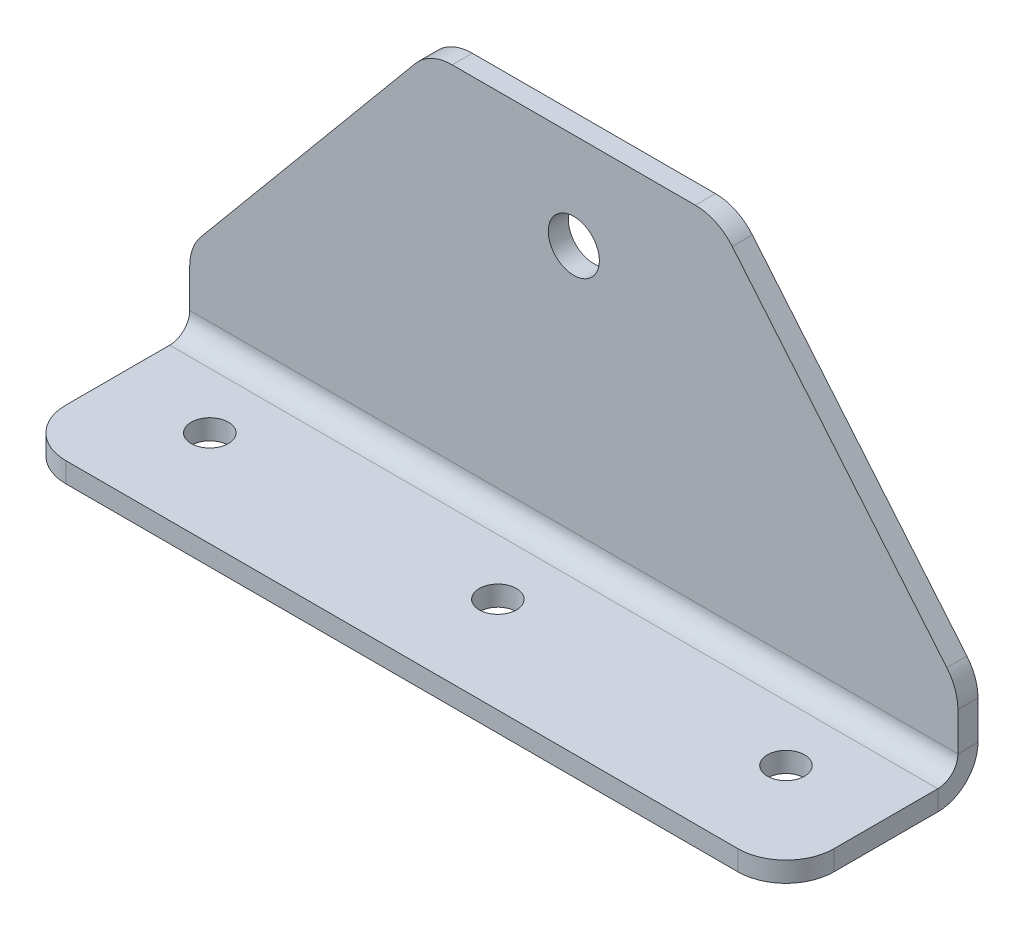
ISO-10303-21;
HEADER;
FILE_DESCRIPTION(('STEP AP214'),'2;1');
FILE_NAME('part.step','',(''),(''),'','','');
FILE_SCHEMA(('AUTOMOTIVE_DESIGN { 1 0 10303 214 1 1 1 1 }'));
ENDSEC;
DATA;
#1=APPLICATION_CONTEXT('core data for automotive mechanical design processes');
#2=APPLICATION_PROTOCOL_DEFINITION('international standard','automotive_design',2000,#1);
#3=PRODUCT_CONTEXT('',#1,'mechanical');
#4=PRODUCT('Part','Part','',(#3));
#5=PRODUCT_RELATED_PRODUCT_CATEGORY('part','',(#4));
#6=PRODUCT_DEFINITION_FORMATION('','',#4);
#7=PRODUCT_DEFINITION_CONTEXT('part definition',#1,'design');
#8=PRODUCT_DEFINITION('design','',#6,#7);
#9=PRODUCT_DEFINITION_SHAPE('','',#8);
#10=(LENGTH_UNIT() NAMED_UNIT(*) SI_UNIT(.MILLI.,.METRE.));
#11=(NAMED_UNIT(*) PLANE_ANGLE_UNIT() SI_UNIT($,.RADIAN.));
#12=(NAMED_UNIT(*) SI_UNIT($,.STERADIAN.) SOLID_ANGLE_UNIT());
#13=UNCERTAINTY_MEASURE_WITH_UNIT(LENGTH_MEASURE(1.E-05),#10,'distance_accuracy_value','');
#14=(GEOMETRIC_REPRESENTATION_CONTEXT(3) GLOBAL_UNCERTAINTY_ASSIGNED_CONTEXT((#13)) GLOBAL_UNIT_ASSIGNED_CONTEXT((#10,
#11,#12)) REPRESENTATION_CONTEXT('',''));
#15=CARTESIAN_POINT('',(0.,0.,0.));
#16=DIRECTION('',(0.,0.,1.));
#17=DIRECTION('',(1.,0.,0.));
#18=AXIS2_PLACEMENT_3D('',#15,#16,#17);
#19=CARTESIAN_POINT('',(101.6,12.7,-2.65684));
#20=DIRECTION('',(1.,0.,0.));
#21=DIRECTION('',(0.,0.,-1.));
#22=AXIS2_PLACEMENT_3D('',#19,#20,#21);
#23=PLANE('',#22);
#24=DIRECTION('',(0.,1.,0.));
#25=VECTOR('',#24,1.);
#26=CARTESIAN_POINT('',(101.6,12.7,-2.65684));
#27=LINE('',#26,#25);
#28=CARTESIAN_POINT('',(101.6,5.31368,-2.65684000000001));
#29=VERTEX_POINT('',#28);
#30=CARTESIAN_POINT('',(101.6,10.4009829115986,-2.65684));
#31=VERTEX_POINT('',#30);
#32=EDGE_CURVE('E266',#29,#31,#27,.T.);
#33=ORIENTED_EDGE('',*,*,#32,.T.);
#34=DIRECTION('',(0.,0.,1.));
#35=VECTOR('',#34,1.);
#36=CARTESIAN_POINT('',(101.6,10.4009829115986,-2.65684));
#37=LINE('',#36,#35);
#38=CARTESIAN_POINT('',(101.6,10.4009829115986,0.));
#39=VERTEX_POINT('',#38);
#40=EDGE_CURVE('E327',#31,#39,#37,.T.);
#41=ORIENTED_EDGE('',*,*,#40,.T.);
#42=DIRECTION('',(0.,1.,0.));
#43=VECTOR('',#42,1.);
#44=CARTESIAN_POINT('',(101.6,12.7,0.));
#45=LINE('',#44,#43);
#46=CARTESIAN_POINT('',(101.6,5.31367999999999,0.));
#47=VERTEX_POINT('',#46);
#48=EDGE_CURVE('E263',#47,#39,#45,.T.);
#49=ORIENTED_EDGE('',*,*,#48,.F.);
#50=DIRECTION('',(0.,0.,-1.));
#51=VECTOR('',#50,1.);
#52=CARTESIAN_POINT('',(101.6,5.31367999999999,0.));
#53=LINE('',#52,#51);
#54=EDGE_CURVE('E248',#47,#29,#53,.T.);
#55=ORIENTED_EDGE('',*,*,#54,.T.);
#56=EDGE_LOOP('',(#33,#41,#49,#55));
#57=FACE_BOUND('',#56,.T.);
#58=ADVANCED_FACE('F69',(#57),#23,.T.);
#59=CARTESIAN_POINT('',(0.,0.,-2.65684));
#60=DIRECTION('',(0.,0.,-1.));
#61=DIRECTION('',(-1.,0.,0.));
#62=AXIS2_PLACEMENT_3D('',#59,#60,#61);
#63=PLANE('',#62);
#64=CARTESIAN_POINT('',(50.8,38.0999999999999,-2.65684000000001));
#65=DIRECTION('',(0.,0.,1.));
#66=DIRECTION('',(1.,0.,0.));
#67=AXIS2_PLACEMENT_3D('',#64,#65,#66);
#68=CIRCLE('',#67,3.3782);
#69=CARTESIAN_POINT('',(54.1782,38.0999999999999,-2.65684000000001));
#70=VERTEX_POINT('',#69);
#71=EDGE_CURVE('E511',#70,#70,#68,.T.);
#72=ORIENTED_EDGE('',*,*,#71,.T.);
#73=EDGE_LOOP('',(#72));
#74=FACE_BOUND('',#73,.T.);
#75=DIRECTION('',(-0.64018439966448,0.768221279597376,0.));
#76=VECTOR('',#75,1.);
#77=CARTESIAN_POINT('',(69.85,50.8,-2.65684));
#78=LINE('',#77,#76);
#79=CARTESIAN_POINT('',(100.128205125443,14.466153849468,-2.65684));
#80=VERTEX_POINT('',#79);
#81=CARTESIAN_POINT('',(71.7540242184421,48.5151709378694,-2.65684));
#82=VERTEX_POINT('',#81);
#83=EDGE_CURVE('E270',#80,#82,#78,.T.);
#84=ORIENTED_EDGE('',*,*,#83,.F.);
#85=CARTESIAN_POINT('',(95.25,10.4009829115986,-2.65684));
#86=DIRECTION('',(0.,0.,-1.));
#87=DIRECTION('',(-1.,0.,0.));
#88=AXIS2_PLACEMENT_3D('',#85,#86,#87);
#89=CIRCLE('',#88,6.35);
#90=EDGE_CURVE('E358',#80,#31,#89,.T.);
#91=ORIENTED_EDGE('',*,*,#90,.T.);
#92=ORIENTED_EDGE('',*,*,#32,.F.);
#93=DIRECTION('',(1.,0.,0.));
#94=VECTOR('',#93,1.);
#95=CARTESIAN_POINT('',(101.6,5.31368,-2.65684000000001));
#96=LINE('',#95,#94);
#97=CARTESIAN_POINT('',(0.,5.31368000000001,-2.65684));
#98=VERTEX_POINT('',#97);
#99=EDGE_CURVE('E209',#29,#98,#96,.F.);
#100=ORIENTED_EDGE('',*,*,#99,.T.);
#101=DIRECTION('',(0.,-1.,0.));
#102=VECTOR('',#101,1.);
#103=CARTESIAN_POINT('',(0.,0.,-2.65684));
#104=LINE('',#103,#102);
#105=CARTESIAN_POINT('',(0.,10.4009829115986,-2.65684));
#106=VERTEX_POINT('',#105);
#107=EDGE_CURVE('E282',#106,#98,#104,.T.);
#108=ORIENTED_EDGE('',*,*,#107,.F.);
#109=CARTESIAN_POINT('',(6.35,10.4009829115986,-2.65684));
#110=DIRECTION('',(0.,0.,-1.));
#111=DIRECTION('',(-1.,0.,0.));
#112=AXIS2_PLACEMENT_3D('',#109,#110,#111);
#113=CIRCLE('',#112,6.35);
#114=CARTESIAN_POINT('',(1.47179487455666,14.466153849468,-2.65684));
#115=VERTEX_POINT('',#114);
#116=EDGE_CURVE('E350',#106,#115,#113,.T.);
#117=ORIENTED_EDGE('',*,*,#116,.T.);
#118=DIRECTION('',(-0.64018439966448,-0.768221279597376,0.));
#119=VECTOR('',#118,1.);
#120=CARTESIAN_POINT('',(0.,12.7,-2.65684));
#121=LINE('',#120,#119);
#122=CARTESIAN_POINT('',(29.8459757815579,48.5151709378694,-2.65684));
#123=VERTEX_POINT('',#122);
#124=EDGE_CURVE('E278',#123,#115,#121,.T.);
#125=ORIENTED_EDGE('',*,*,#124,.F.);
#126=CARTESIAN_POINT('',(34.7241809070012,44.45,-2.65684));
#127=DIRECTION('',(0.,0.,-1.));
#128=DIRECTION('',(-1.,0.,0.));
#129=AXIS2_PLACEMENT_3D('',#126,#127,#128);
#130=CIRCLE('',#129,6.35);
#131=CARTESIAN_POINT('',(34.7241809070012,50.8,-2.65684));
#132=VERTEX_POINT('',#131);
#133=EDGE_CURVE('E87',#123,#132,#130,.T.);
#134=ORIENTED_EDGE('',*,*,#133,.T.);
#135=DIRECTION('',(-1.,0.,0.));
#136=VECTOR('',#135,1.);
#137=CARTESIAN_POINT('',(31.75,50.8,-2.65684));
#138=LINE('',#137,#136);
#139=CARTESIAN_POINT('',(66.8758190929988,50.8,-2.65684));
#140=VERTEX_POINT('',#139);
#141=EDGE_CURVE('E275',#140,#132,#138,.T.);
#142=ORIENTED_EDGE('',*,*,#141,.F.);
#143=CARTESIAN_POINT('',(66.8758190929988,44.45,-2.65684));
#144=DIRECTION('',(0.,0.,-1.));
#145=DIRECTION('',(-1.,0.,0.));
#146=AXIS2_PLACEMENT_3D('',#143,#144,#145);
#147=CIRCLE('',#146,6.35);
#148=EDGE_CURVE('E355',#140,#82,#147,.T.);
#149=ORIENTED_EDGE('',*,*,#148,.T.);
#150=EDGE_LOOP('',(#84,#91,#92,#100,#108,#117,#125,#134,#142,#149));
#151=FACE_BOUND('',#150,.T.);
#152=ADVANCED_FACE('F444',(#74,#151),#63,.T.);
#153=CARTESIAN_POINT('',(0.,0.,0.));
#154=DIRECTION('',(0.,0.,-1.));
#155=DIRECTION('',(-1.,0.,0.));
#156=AXIS2_PLACEMENT_3D('',#153,#154,#155);
#157=PLANE('',#156);
#158=CARTESIAN_POINT('',(50.8,38.0999999999999,0.));
#159=DIRECTION('',(0.,0.,1.));
#160=DIRECTION('',(1.,0.,0.));
#161=AXIS2_PLACEMENT_3D('',#158,#159,#160);
#162=CIRCLE('',#161,3.37819999999996);
#163=CARTESIAN_POINT('',(54.1782,38.0999999999999,0.));
#164=VERTEX_POINT('',#163);
#165=EDGE_CURVE('E514',#164,#164,#162,.T.);
#166=ORIENTED_EDGE('',*,*,#165,.F.);
#167=EDGE_LOOP('',(#166));
#168=FACE_BOUND('',#167,.T.);
#169=ORIENTED_EDGE('',*,*,#48,.T.);
#170=CARTESIAN_POINT('',(95.25,10.4009829115986,0.));
#171=DIRECTION('',(0.,0.,-1.));
#172=DIRECTION('',(-1.,0.,0.));
#173=AXIS2_PLACEMENT_3D('',#170,#171,#172);
#174=CIRCLE('',#173,6.35);
#175=CARTESIAN_POINT('',(100.128205125443,14.466153849468,0.));
#176=VERTEX_POINT('',#175);
#177=EDGE_CURVE('E340',#39,#176,#174,.F.);
#178=ORIENTED_EDGE('',*,*,#177,.T.);
#179=DIRECTION('',(-0.64018439966448,0.768221279597376,0.));
#180=VECTOR('',#179,1.);
#181=CARTESIAN_POINT('',(69.85,50.8,0.));
#182=LINE('',#181,#180);
#183=CARTESIAN_POINT('',(71.7540242184421,48.5151709378694,0.));
#184=VERTEX_POINT('',#183);
#185=EDGE_CURVE('E289',#176,#184,#182,.T.);
#186=ORIENTED_EDGE('',*,*,#185,.T.);
#187=CARTESIAN_POINT('',(66.8758190929988,44.45,0.));
#188=DIRECTION('',(0.,0.,-1.));
#189=DIRECTION('',(-1.,0.,0.));
#190=AXIS2_PLACEMENT_3D('',#187,#188,#189);
#191=CIRCLE('',#190,6.35);
#192=CARTESIAN_POINT('',(66.8758190929988,50.8,0.));
#193=VERTEX_POINT('',#192);
#194=EDGE_CURVE('E337',#184,#193,#191,.F.);
#195=ORIENTED_EDGE('',*,*,#194,.T.);
#196=DIRECTION('',(-1.,0.,0.));
#197=VECTOR('',#196,1.);
#198=CARTESIAN_POINT('',(31.75,50.8,0.));
#199=LINE('',#198,#197);
#200=CARTESIAN_POINT('',(34.7241809070012,50.8,0.));
#201=VERTEX_POINT('',#200);
#202=EDGE_CURVE('E293',#193,#201,#199,.T.);
#203=ORIENTED_EDGE('',*,*,#202,.T.);
#204=CARTESIAN_POINT('',(34.7241809070012,44.45,0.));
#205=DIRECTION('',(0.,0.,-1.));
#206=DIRECTION('',(-1.,0.,0.));
#207=AXIS2_PLACEMENT_3D('',#204,#205,#206);
#208=CIRCLE('',#207,6.35);
#209=CARTESIAN_POINT('',(29.8459757815579,48.5151709378694,0.));
#210=VERTEX_POINT('',#209);
#211=EDGE_CURVE('E334',#201,#210,#208,.F.);
#212=ORIENTED_EDGE('',*,*,#211,.T.);
#213=DIRECTION('',(-0.64018439966448,-0.768221279597376,0.));
#214=VECTOR('',#213,1.);
#215=CARTESIAN_POINT('',(0.,12.7,0.));
#216=LINE('',#215,#214);
#217=CARTESIAN_POINT('',(1.47179487455666,14.466153849468,0.));
#218=VERTEX_POINT('',#217);
#219=EDGE_CURVE('E297',#210,#218,#216,.T.);
#220=ORIENTED_EDGE('',*,*,#219,.T.);
#221=CARTESIAN_POINT('',(6.35,10.4009829115986,0.));
#222=DIRECTION('',(0.,0.,-1.));
#223=DIRECTION('',(-1.,0.,0.));
#224=AXIS2_PLACEMENT_3D('',#221,#222,#223);
#225=CIRCLE('',#224,6.35);
#226=CARTESIAN_POINT('',(0.,10.4009829115986,0.));
#227=VERTEX_POINT('',#226);
#228=EDGE_CURVE('E331',#218,#227,#225,.F.);
#229=ORIENTED_EDGE('',*,*,#228,.T.);
#230=DIRECTION('',(0.,-1.,0.));
#231=VECTOR('',#230,1.);
#232=CARTESIAN_POINT('',(0.,0.,0.));
#233=LINE('',#232,#231);
#234=CARTESIAN_POINT('',(0.,5.31367999999999,0.));
#235=VERTEX_POINT('',#234);
#236=EDGE_CURVE('E271',#227,#235,#233,.T.);
#237=ORIENTED_EDGE('',*,*,#236,.T.);
#238=DIRECTION('',(1.,0.,0.));
#239=VECTOR('',#238,1.);
#240=CARTESIAN_POINT('',(101.6,5.31367999999999,0.));
#241=LINE('',#240,#239);
#242=EDGE_CURVE('E253',#47,#235,#241,.F.);
#243=ORIENTED_EDGE('',*,*,#242,.F.);
#244=EDGE_LOOP('',(#169,#178,#186,#195,#203,#212,#220,#229,#237,#243));
#245=FACE_BOUND('',#244,.T.);
#246=ADVANCED_FACE('F450',(#168,#245),#157,.F.);
#247=CARTESIAN_POINT('',(0.,0.,-2.65684));
#248=DIRECTION('',(-1.,0.,0.));
#249=DIRECTION('',(0.,0.,1.));
#250=AXIS2_PLACEMENT_3D('',#247,#248,#249);
#251=PLANE('',#250);
#252=ORIENTED_EDGE('',*,*,#236,.F.);
#253=DIRECTION('',(0.,0.,1.));
#254=VECTOR('',#253,1.);
#255=CARTESIAN_POINT('',(0.,10.4009829115986,-2.65684));
#256=LINE('',#255,#254);
#257=EDGE_CURVE('E13',#227,#106,#256,.F.);
#258=ORIENTED_EDGE('',*,*,#257,.T.);
#259=ORIENTED_EDGE('',*,*,#107,.T.);
#260=DIRECTION('',(0.,0.,-1.));
#261=VECTOR('',#260,1.);
#262=CARTESIAN_POINT('',(0.,5.31367999999999,0.));
#263=LINE('',#262,#261);
#264=EDGE_CURVE('E259',#235,#98,#263,.T.);
#265=ORIENTED_EDGE('',*,*,#264,.F.);
#266=EDGE_LOOP('',(#252,#258,#259,#265));
#267=FACE_BOUND('',#266,.T.);
#268=ADVANCED_FACE('F464',(#267),#251,.T.);
#269=CARTESIAN_POINT('',(0.,12.7,-2.65684));
#270=DIRECTION('',(-0.768221279597376,0.64018439966448,0.));
#271=DIRECTION('',(-0.64018439966448,-0.768221279597376,0.));
#272=AXIS2_PLACEMENT_3D('',#269,#270,#271);
#273=PLANE('',#272);
#274=ORIENTED_EDGE('',*,*,#219,.F.);
#275=DIRECTION('',(0.,0.,1.));
#276=VECTOR('',#275,1.);
#277=CARTESIAN_POINT('',(29.8459757815579,48.5151709378694,-2.65684));
#278=LINE('',#277,#276);
#279=EDGE_CURVE('E79',#210,#123,#278,.F.);
#280=ORIENTED_EDGE('',*,*,#279,.T.);
#281=ORIENTED_EDGE('',*,*,#124,.T.);
#282=DIRECTION('',(0.,0.,1.));
#283=VECTOR('',#282,1.);
#284=CARTESIAN_POINT('',(1.47179487455666,14.466153849468,-2.65684));
#285=LINE('',#284,#283);
#286=EDGE_CURVE('E367',#115,#218,#285,.T.);
#287=ORIENTED_EDGE('',*,*,#286,.T.);
#288=EDGE_LOOP('',(#274,#280,#281,#287));
#289=FACE_BOUND('',#288,.T.);
#290=ADVANCED_FACE('F461',(#289),#273,.T.);
#291=CARTESIAN_POINT('',(31.75,50.8,-2.65684));
#292=DIRECTION('',(0.,1.,0.));
#293=DIRECTION('',(-1.,0.,0.));
#294=AXIS2_PLACEMENT_3D('',#291,#292,#293);
#295=PLANE('',#294);
#296=ORIENTED_EDGE('',*,*,#202,.F.);
#297=DIRECTION('',(0.,0.,1.));
#298=VECTOR('',#297,1.);
#299=CARTESIAN_POINT('',(66.8758190929988,50.8,-2.65684));
#300=LINE('',#299,#298);
#301=EDGE_CURVE('E94',#193,#140,#300,.F.);
#302=ORIENTED_EDGE('',*,*,#301,.T.);
#303=ORIENTED_EDGE('',*,*,#141,.T.);
#304=DIRECTION('',(0.,0.,1.));
#305=VECTOR('',#304,1.);
#306=CARTESIAN_POINT('',(34.7241809070012,50.8,-2.65684));
#307=LINE('',#306,#305);
#308=EDGE_CURVE('E361',#132,#201,#307,.T.);
#309=ORIENTED_EDGE('',*,*,#308,.T.);
#310=EDGE_LOOP('',(#296,#302,#303,#309));
#311=FACE_BOUND('',#310,.T.);
#312=ADVANCED_FACE('F457',(#311),#295,.T.);
#313=CARTESIAN_POINT('',(69.85,50.8,-2.65684));
#314=DIRECTION('',(0.768221279597375,0.64018439966448,0.));
#315=DIRECTION('',(-0.64018439966448,0.768221279597376,0.));
#316=AXIS2_PLACEMENT_3D('',#313,#314,#315);
#317=PLANE('',#316);
#318=ORIENTED_EDGE('',*,*,#185,.F.);
#319=DIRECTION('',(0.,0.,1.));
#320=VECTOR('',#319,1.);
#321=CARTESIAN_POINT('',(100.128205125443,14.466153849468,-2.65684));
#322=LINE('',#321,#320);
#323=EDGE_CURVE('E347',#176,#80,#322,.F.);
#324=ORIENTED_EDGE('',*,*,#323,.T.);
#325=ORIENTED_EDGE('',*,*,#83,.T.);
#326=DIRECTION('',(0.,0.,1.));
#327=VECTOR('',#326,1.);
#328=CARTESIAN_POINT('',(71.7540242184421,48.5151709378694,-2.65684));
#329=LINE('',#328,#327);
#330=EDGE_CURVE('E343',#82,#184,#329,.T.);
#331=ORIENTED_EDGE('',*,*,#330,.T.);
#332=EDGE_LOOP('',(#318,#324,#325,#331));
#333=FACE_BOUND('',#332,.T.);
#334=ADVANCED_FACE('F454',(#333),#317,.T.);
#335=CARTESIAN_POINT('',(0.,5.31367999999999,2.65684));
#336=DIRECTION('',(-1.,0.,0.));
#337=DIRECTION('',(0.,0.,1.));
#338=AXIS2_PLACEMENT_3D('',#335,#336,#337);
#339=PLANE('',#338);
#340=DIRECTION('',(0.,-1.,0.));
#341=VECTOR('',#340,1.);
#342=CARTESIAN_POINT('',(0.,0.,2.65683999999998));
#343=LINE('',#342,#341);
#344=CARTESIAN_POINT('',(0.,2.65683999999999,2.65683999999999));
#345=VERTEX_POINT('',#344);
#346=CARTESIAN_POINT('',(0.,0.,2.65683999999998));
#347=VERTEX_POINT('',#346);
#348=EDGE_CURVE('E239',#345,#347,#343,.T.);
#349=ORIENTED_EDGE('',*,*,#348,.F.);
#350=CARTESIAN_POINT('',(0.,5.31367999999999,2.65684));
#351=DIRECTION('',(1.,0.,0.));
#352=DIRECTION('',(0.,0.,-1.));
#353=AXIS2_PLACEMENT_3D('',#350,#351,#352);
#354=CIRCLE('',#353,2.65684);
#355=EDGE_CURVE('E213',#235,#345,#354,.F.);
#356=ORIENTED_EDGE('',*,*,#355,.F.);
#357=ORIENTED_EDGE('',*,*,#264,.T.);
#358=CARTESIAN_POINT('',(0.,5.31367999999999,2.65684));
#359=DIRECTION('',(1.,0.,0.));
#360=DIRECTION('',(0.,0.,-1.));
#361=AXIS2_PLACEMENT_3D('',#358,#359,#360);
#362=CIRCLE('',#361,5.31368);
#363=EDGE_CURVE('E246',#98,#347,#362,.F.);
#364=ORIENTED_EDGE('',*,*,#363,.T.);
#365=EDGE_LOOP('',(#349,#356,#357,#364));
#366=FACE_BOUND('',#365,.T.);
#367=ADVANCED_FACE('F424',(#366),#339,.T.);
#368=CARTESIAN_POINT('',(101.6,5.31367999999999,2.65683999999999));
#369=DIRECTION('',(-1.,0.,0.));
#370=DIRECTION('',(0.,0.,1.));
#371=AXIS2_PLACEMENT_3D('',#368,#369,#370);
#372=PLANE('',#371);
#373=CARTESIAN_POINT('',(101.6,5.31367999999999,2.65683999999999));
#374=DIRECTION('',(1.,0.,0.));
#375=DIRECTION('',(0.,0.,-1.));
#376=AXIS2_PLACEMENT_3D('',#373,#374,#375);
#377=CIRCLE('',#376,2.65684);
#378=CARTESIAN_POINT('',(101.6,2.65683999999999,2.65683999999998));
#379=VERTEX_POINT('',#378);
#380=EDGE_CURVE('E198',#379,#47,#377,.T.);
#381=ORIENTED_EDGE('',*,*,#380,.F.);
#382=DIRECTION('',(0.,-1.,0.));
#383=VECTOR('',#382,1.);
#384=CARTESIAN_POINT('',(101.6,2.65683999999999,2.65683999999999));
#385=LINE('',#384,#383);
#386=CARTESIAN_POINT('',(101.6,0.,2.65683999999998));
#387=VERTEX_POINT('',#386);
#388=EDGE_CURVE('E191',#379,#387,#385,.T.);
#389=ORIENTED_EDGE('',*,*,#388,.T.);
#390=CARTESIAN_POINT('',(101.6,5.31367999999999,2.65683999999999));
#391=DIRECTION('',(1.,0.,0.));
#392=DIRECTION('',(0.,0.,-1.));
#393=AXIS2_PLACEMENT_3D('',#390,#391,#392);
#394=CIRCLE('',#393,5.31368);
#395=EDGE_CURVE('E203',#387,#29,#394,.T.);
#396=ORIENTED_EDGE('',*,*,#395,.T.);
#397=ORIENTED_EDGE('',*,*,#54,.F.);
#398=EDGE_LOOP('',(#381,#389,#396,#397));
#399=FACE_BOUND('',#398,.T.);
#400=ADVANCED_FACE('F216',(#399),#372,.F.);
#401=CARTESIAN_POINT('',(101.6,5.31367999999999,2.65683999999999));
#402=DIRECTION('',(1.,0.,0.));
#403=DIRECTION('',(0.,-1.,0.));
#404=AXIS2_PLACEMENT_3D('',#401,#402,#403);
#405=CYLINDRICAL_SURFACE('',#404,5.31368);
#406=ORIENTED_EDGE('',*,*,#99,.F.);
#407=ORIENTED_EDGE('',*,*,#395,.F.);
#408=DIRECTION('',(1.,0.,0.));
#409=VECTOR('',#408,1.);
#410=CARTESIAN_POINT('',(0.,0.,2.65683999999998));
#411=LINE('',#410,#409);
#412=EDGE_CURVE('E206',#347,#387,#411,.T.);
#413=ORIENTED_EDGE('',*,*,#412,.F.);
#414=ORIENTED_EDGE('',*,*,#363,.F.);
#415=EDGE_LOOP('',(#406,#407,#413,#414));
#416=FACE_BOUND('',#415,.T.);
#417=ADVANCED_FACE('F204',(#416),#405,.T.);
#418=CARTESIAN_POINT('',(101.6,5.31367999999999,2.65683999999999));
#419=DIRECTION('',(1.,0.,0.));
#420=DIRECTION('',(0.,-1.,0.));
#421=AXIS2_PLACEMENT_3D('',#418,#419,#420);
#422=CYLINDRICAL_SURFACE('',#421,2.65684);
#423=ORIENTED_EDGE('',*,*,#242,.T.);
#424=ORIENTED_EDGE('',*,*,#355,.T.);
#425=DIRECTION('',(-1.,0.,0.));
#426=VECTOR('',#425,1.);
#427=CARTESIAN_POINT('',(0.,2.65683999999999,2.65683999999999));
#428=LINE('',#427,#426);
#429=EDGE_CURVE('E219',#345,#379,#428,.F.);
#430=ORIENTED_EDGE('',*,*,#429,.T.);
#431=ORIENTED_EDGE('',*,*,#380,.T.);
#432=EDGE_LOOP('',(#423,#424,#430,#431));
#433=FACE_BOUND('',#432,.T.);
#434=ADVANCED_FACE('F428',(#433),#422,.F.);
#435=CARTESIAN_POINT('',(101.6,0.,0.));
#436=DIRECTION('',(1.,0.,0.));
#437=DIRECTION('',(0.,1.,0.));
#438=AXIS2_PLACEMENT_3D('',#435,#436,#437);
#439=PLANE('',#438);
#440=DIRECTION('',(0.,0.,1.));
#441=VECTOR('',#440,1.);
#442=CARTESIAN_POINT('',(101.6,2.65684,0.));
#443=LINE('',#442,#441);
#444=CARTESIAN_POINT('',(101.6,2.65683999999995,16.39316));
#445=VERTEX_POINT('',#444);
#446=EDGE_CURVE('E403',#445,#379,#443,.F.);
#447=ORIENTED_EDGE('',*,*,#446,.F.);
#448=DIRECTION('',(0.,1.,0.));
#449=VECTOR('',#448,1.);
#450=CARTESIAN_POINT('',(101.6,0.,16.39316));
#451=LINE('',#450,#449);
#452=CARTESIAN_POINT('',(101.6,0.,16.39316));
#453=VERTEX_POINT('',#452);
#454=EDGE_CURVE('E193',#445,#453,#451,.F.);
#455=ORIENTED_EDGE('',*,*,#454,.T.);
#456=DIRECTION('',(0.,0.,-1.));
#457=VECTOR('',#456,1.);
#458=CARTESIAN_POINT('',(101.6,0.,0.));
#459=LINE('',#458,#457);
#460=EDGE_CURVE('E186',#453,#387,#459,.T.);
#461=ORIENTED_EDGE('',*,*,#460,.T.);
#462=ORIENTED_EDGE('',*,*,#388,.F.);
#463=EDGE_LOOP('',(#447,#455,#461,#462));
#464=FACE_BOUND('',#463,.T.);
#465=ADVANCED_FACE('F189',(#464),#439,.T.);
#466=CARTESIAN_POINT('',(0.,0.,22.74316));
#467=DIRECTION('',(-1.,0.,0.));
#468=DIRECTION('',(0.,0.,1.));
#469=AXIS2_PLACEMENT_3D('',#466,#467,#468);
#470=PLANE('',#469);
#471=DIRECTION('',(0.,0.,1.));
#472=VECTOR('',#471,1.);
#473=CARTESIAN_POINT('',(0.,0.,22.74316));
#474=LINE('',#473,#472);
#475=CARTESIAN_POINT('',(0.,0.,16.39316));
#476=VERTEX_POINT('',#475);
#477=EDGE_CURVE('E225',#347,#476,#474,.T.);
#478=ORIENTED_EDGE('',*,*,#477,.T.);
#479=DIRECTION('',(0.,1.,0.));
#480=VECTOR('',#479,1.);
#481=CARTESIAN_POINT('',(0.,0.,16.39316));
#482=LINE('',#481,#480);
#483=CARTESIAN_POINT('',(0.,2.65683999999994,16.39316));
#484=VERTEX_POINT('',#483);
#485=EDGE_CURVE('E285',#476,#484,#482,.T.);
#486=ORIENTED_EDGE('',*,*,#485,.T.);
#487=DIRECTION('',(0.,0.,-1.));
#488=VECTOR('',#487,1.);
#489=CARTESIAN_POINT('',(0.,2.65684,0.));
#490=LINE('',#489,#488);
#491=EDGE_CURVE('E227',#345,#484,#490,.F.);
#492=ORIENTED_EDGE('',*,*,#491,.F.);
#493=ORIENTED_EDGE('',*,*,#348,.T.);
#494=EDGE_LOOP('',(#478,#486,#492,#493));
#495=FACE_BOUND('',#494,.T.);
#496=ADVANCED_FACE('F420',(#495),#470,.T.);
#497=CARTESIAN_POINT('',(0.,0.,0.));
#498=DIRECTION('',(0.,-1.,0.));
#499=DIRECTION('',(0.,0.,-1.));
#500=AXIS2_PLACEMENT_3D('',#497,#498,#499);
#501=PLANE('',#500);
#502=CARTESIAN_POINT('',(88.9,0.,10.04316));
#503=DIRECTION('',(0.,-1.,0.));
#504=DIRECTION('',(0.,0.,-1.));
#505=AXIS2_PLACEMENT_3D('',#502,#503,#504);
#506=CIRCLE('',#505,2.45745);
#507=CARTESIAN_POINT('',(88.9,0.,7.58570999999997));
#508=VERTEX_POINT('',#507);
#509=EDGE_CURVE('E394',#508,#508,#506,.T.);
#510=ORIENTED_EDGE('',*,*,#509,.F.);
#511=EDGE_LOOP('',(#510));
#512=FACE_BOUND('',#511,.T.);
#513=CARTESIAN_POINT('',(50.8,0.,10.04316));
#514=DIRECTION('',(0.,-1.,0.));
#515=DIRECTION('',(0.,0.,-1.));
#516=AXIS2_PLACEMENT_3D('',#513,#514,#515);
#517=CIRCLE('',#516,2.45744999999999);
#518=CARTESIAN_POINT('',(50.8,0.,7.58570999999998));
#519=VERTEX_POINT('',#518);
#520=EDGE_CURVE('E379',#519,#519,#517,.T.);
#521=ORIENTED_EDGE('',*,*,#520,.F.);
#522=EDGE_LOOP('',(#521));
#523=FACE_BOUND('',#522,.T.);
#524=CARTESIAN_POINT('',(12.7,0.,10.04316));
#525=DIRECTION('',(0.,-1.,0.));
#526=DIRECTION('',(0.,0.,-1.));
#527=AXIS2_PLACEMENT_3D('',#524,#525,#526);
#528=CIRCLE('',#527,2.45744999999999);
#529=CARTESIAN_POINT('',(12.7,0.,7.58570999999998));
#530=VERTEX_POINT('',#529);
#531=EDGE_CURVE('E375',#530,#530,#528,.T.);
#532=ORIENTED_EDGE('',*,*,#531,.F.);
#533=EDGE_LOOP('',(#532));
#534=FACE_BOUND('',#533,.T.);
#535=DIRECTION('',(1.,0.,0.));
#536=VECTOR('',#535,1.);
#537=CARTESIAN_POINT('',(101.6,0.,22.74316));
#538=LINE('',#537,#536);
#539=CARTESIAN_POINT('',(6.34999999999998,0.,22.74316));
#540=VERTEX_POINT('',#539);
#541=CARTESIAN_POINT('',(95.25,0.,22.74316));
#542=VERTEX_POINT('',#541);
#543=EDGE_CURVE('E199',#540,#542,#538,.T.);
#544=ORIENTED_EDGE('',*,*,#543,.F.);
#545=CARTESIAN_POINT('',(6.34999999999998,0.,16.39316));
#546=DIRECTION('',(0.,-1.,0.));
#547=DIRECTION('',(0.,0.,-1.));
#548=AXIS2_PLACEMENT_3D('',#545,#546,#547);
#549=CIRCLE('',#548,6.35);
#550=EDGE_CURVE('E322',#540,#476,#549,.T.);
#551=ORIENTED_EDGE('',*,*,#550,.T.);
#552=ORIENTED_EDGE('',*,*,#477,.F.);
#553=ORIENTED_EDGE('',*,*,#412,.T.);
#554=ORIENTED_EDGE('',*,*,#460,.F.);
#555=CARTESIAN_POINT('',(95.25,0.,16.39316));
#556=DIRECTION('',(0.,-1.,0.));
#557=DIRECTION('',(0.,0.,-1.));
#558=AXIS2_PLACEMENT_3D('',#555,#556,#557);
#559=CIRCLE('',#558,6.35);
#560=EDGE_CURVE('E319',#453,#542,#559,.T.);
#561=ORIENTED_EDGE('',*,*,#560,.T.);
#562=EDGE_LOOP('',(#544,#551,#552,#553,#554,#561));
#563=FACE_BOUND('',#562,.T.);
#564=ADVANCED_FACE('F223',(#512,#523,#534,#563),#501,.T.);
#565=CARTESIAN_POINT('',(0.,2.65684,0.));
#566=DIRECTION('',(0.,-1.,0.));
#567=DIRECTION('',(0.,0.,-1.));
#568=AXIS2_PLACEMENT_3D('',#565,#566,#567);
#569=PLANE('',#568);
#570=CARTESIAN_POINT('',(88.9,2.65683999999997,10.04316));
#571=DIRECTION('',(0.,-1.,0.));
#572=DIRECTION('',(0.,0.,-1.));
#573=AXIS2_PLACEMENT_3D('',#570,#571,#572);
#574=CIRCLE('',#573,2.45744999999999);
#575=CARTESIAN_POINT('',(88.9,2.65683999999998,7.58570999999998));
#576=VERTEX_POINT('',#575);
#577=EDGE_CURVE('E73',#576,#576,#574,.T.);
#578=ORIENTED_EDGE('',*,*,#577,.T.);
#579=EDGE_LOOP('',(#578));
#580=FACE_BOUND('',#579,.T.);
#581=CARTESIAN_POINT('',(50.8,2.65683999999997,10.04316));
#582=DIRECTION('',(0.,-1.,0.));
#583=DIRECTION('',(0.,0.,-1.));
#584=AXIS2_PLACEMENT_3D('',#581,#582,#583);
#585=CIRCLE('',#584,2.45744999999999);
#586=CARTESIAN_POINT('',(50.8,2.65683999999997,7.58570999999998));
#587=VERTEX_POINT('',#586);
#588=EDGE_CURVE('E376',#587,#587,#585,.T.);
#589=ORIENTED_EDGE('',*,*,#588,.T.);
#590=EDGE_LOOP('',(#589));
#591=FACE_BOUND('',#590,.T.);
#592=CARTESIAN_POINT('',(12.7,2.65683999999997,10.04316));
#593=DIRECTION('',(0.,-1.,0.));
#594=DIRECTION('',(0.,0.,-1.));
#595=AXIS2_PLACEMENT_3D('',#592,#593,#594);
#596=CIRCLE('',#595,2.45744999999999);
#597=CARTESIAN_POINT('',(12.7,2.65683999999997,7.58570999999998));
#598=VERTEX_POINT('',#597);
#599=EDGE_CURVE('E243',#598,#598,#596,.T.);
#600=ORIENTED_EDGE('',*,*,#599,.T.);
#601=EDGE_LOOP('',(#600));
#602=FACE_BOUND('',#601,.T.);
#603=ORIENTED_EDGE('',*,*,#491,.T.);
#604=CARTESIAN_POINT('',(6.34999999999998,2.65683999999994,16.39316));
#605=DIRECTION('',(0.,-1.,0.));
#606=DIRECTION('',(0.,0.,-1.));
#607=AXIS2_PLACEMENT_3D('',#604,#605,#606);
#608=CIRCLE('',#607,6.35);
#609=CARTESIAN_POINT('',(6.34999999999998,2.65683999999992,22.74316));
#610=VERTEX_POINT('',#609);
#611=EDGE_CURVE('E309',#484,#610,#608,.F.);
#612=ORIENTED_EDGE('',*,*,#611,.T.);
#613=DIRECTION('',(-1.,0.,0.));
#614=VECTOR('',#613,1.);
#615=CARTESIAN_POINT('',(0.,2.65683999999992,22.74316));
#616=LINE('',#615,#614);
#617=CARTESIAN_POINT('',(95.25,2.65683999999992,22.74316));
#618=VERTEX_POINT('',#617);
#619=EDGE_CURVE('E232',#610,#618,#616,.F.);
#620=ORIENTED_EDGE('',*,*,#619,.T.);
#621=CARTESIAN_POINT('',(95.25,2.65683999999995,16.39316));
#622=DIRECTION('',(0.,-1.,0.));
#623=DIRECTION('',(0.,0.,-1.));
#624=AXIS2_PLACEMENT_3D('',#621,#622,#623);
#625=CIRCLE('',#624,6.35);
#626=EDGE_CURVE('E306',#618,#445,#625,.F.);
#627=ORIENTED_EDGE('',*,*,#626,.T.);
#628=ORIENTED_EDGE('',*,*,#446,.T.);
#629=ORIENTED_EDGE('',*,*,#429,.F.);
#630=EDGE_LOOP('',(#603,#612,#620,#627,#628,#629));
#631=FACE_BOUND('',#630,.T.);
#632=ADVANCED_FACE('F410',(#580,#591,#602,#631),#569,.F.);
#633=CARTESIAN_POINT('',(101.6,0.,22.74316));
#634=DIRECTION('',(0.,0.,1.));
#635=DIRECTION('',(0.,-1.,0.));
#636=AXIS2_PLACEMENT_3D('',#633,#634,#635);
#637=PLANE('',#636);
#638=ORIENTED_EDGE('',*,*,#619,.F.);
#639=DIRECTION('',(0.,1.,0.));
#640=VECTOR('',#639,1.);
#641=CARTESIAN_POINT('',(6.34999999999998,0.,22.74316));
#642=LINE('',#641,#640);
#643=EDGE_CURVE('E316',#610,#540,#642,.F.);
#644=ORIENTED_EDGE('',*,*,#643,.T.);
#645=ORIENTED_EDGE('',*,*,#543,.T.);
#646=DIRECTION('',(0.,1.,0.));
#647=VECTOR('',#646,1.);
#648=CARTESIAN_POINT('',(95.25,0.,22.74316));
#649=LINE('',#648,#647);
#650=EDGE_CURVE('E312',#542,#618,#649,.T.);
#651=ORIENTED_EDGE('',*,*,#650,.T.);
#652=EDGE_LOOP('',(#638,#644,#645,#651));
#653=FACE_BOUND('',#652,.T.);
#654=ADVANCED_FACE('F413',(#653),#637,.T.);
#655=CARTESIAN_POINT('',(6.34999999999998,0.,16.39316));
#656=DIRECTION('',(0.,1.,0.));
#657=DIRECTION('',(0.,0.,1.));
#658=AXIS2_PLACEMENT_3D('',#655,#656,#657);
#659=CYLINDRICAL_SURFACE('',#658,6.35);
#660=ORIENTED_EDGE('',*,*,#550,.F.);
#661=ORIENTED_EDGE('',*,*,#643,.F.);
#662=ORIENTED_EDGE('',*,*,#611,.F.);
#663=ORIENTED_EDGE('',*,*,#485,.F.);
#664=EDGE_LOOP('',(#660,#661,#662,#663));
#665=FACE_BOUND('',#664,.T.);
#666=ADVANCED_FACE('F417',(#665),#659,.T.);
#667=CARTESIAN_POINT('',(95.25,0.,16.39316));
#668=DIRECTION('',(0.,1.,0.));
#669=DIRECTION('',(0.,0.,1.));
#670=AXIS2_PLACEMENT_3D('',#667,#668,#669);
#671=CYLINDRICAL_SURFACE('',#670,6.35);
#672=ORIENTED_EDGE('',*,*,#560,.F.);
#673=ORIENTED_EDGE('',*,*,#454,.F.);
#674=ORIENTED_EDGE('',*,*,#626,.F.);
#675=ORIENTED_EDGE('',*,*,#650,.F.);
#676=EDGE_LOOP('',(#672,#673,#674,#675));
#677=FACE_BOUND('',#676,.T.);
#678=ADVANCED_FACE('F431',(#677),#671,.T.);
#679=CARTESIAN_POINT('',(95.25,10.4009829115986,-2.65684));
#680=DIRECTION('',(0.,0.,1.));
#681=DIRECTION('',(1.,0.,0.));
#682=AXIS2_PLACEMENT_3D('',#679,#680,#681);
#683=CYLINDRICAL_SURFACE('',#682,6.35);
#684=ORIENTED_EDGE('',*,*,#90,.F.);
#685=ORIENTED_EDGE('',*,*,#323,.F.);
#686=ORIENTED_EDGE('',*,*,#177,.F.);
#687=ORIENTED_EDGE('',*,*,#40,.F.);
#688=EDGE_LOOP('',(#684,#685,#686,#687));
#689=FACE_BOUND('',#688,.T.);
#690=ADVANCED_FACE('F433',(#689),#683,.T.);
#691=CARTESIAN_POINT('',(66.8758190929988,44.45,-2.65684));
#692=DIRECTION('',(0.,0.,1.));
#693=DIRECTION('',(1.,0.,0.));
#694=AXIS2_PLACEMENT_3D('',#691,#692,#693);
#695=CYLINDRICAL_SURFACE('',#694,6.35);
#696=ORIENTED_EDGE('',*,*,#148,.F.);
#697=ORIENTED_EDGE('',*,*,#301,.F.);
#698=ORIENTED_EDGE('',*,*,#194,.F.);
#699=ORIENTED_EDGE('',*,*,#330,.F.);
#700=EDGE_LOOP('',(#696,#697,#698,#699));
#701=FACE_BOUND('',#700,.T.);
#702=ADVANCED_FACE('F439',(#701),#695,.T.);
#703=CARTESIAN_POINT('',(34.7241809070012,44.45,-2.65684));
#704=DIRECTION('',(0.,0.,1.));
#705=DIRECTION('',(1.,0.,0.));
#706=AXIS2_PLACEMENT_3D('',#703,#704,#705);
#707=CYLINDRICAL_SURFACE('',#706,6.35);
#708=ORIENTED_EDGE('',*,*,#133,.F.);
#709=ORIENTED_EDGE('',*,*,#279,.F.);
#710=ORIENTED_EDGE('',*,*,#211,.F.);
#711=ORIENTED_EDGE('',*,*,#308,.F.);
#712=EDGE_LOOP('',(#708,#709,#710,#711));
#713=FACE_BOUND('',#712,.T.);
#714=ADVANCED_FACE('F552',(#713),#707,.T.);
#715=CARTESIAN_POINT('',(6.35,10.4009829115986,-2.65684));
#716=DIRECTION('',(0.,0.,1.));
#717=DIRECTION('',(1.,0.,0.));
#718=AXIS2_PLACEMENT_3D('',#715,#716,#717);
#719=CYLINDRICAL_SURFACE('',#718,6.35);
#720=ORIENTED_EDGE('',*,*,#116,.F.);
#721=ORIENTED_EDGE('',*,*,#257,.F.);
#722=ORIENTED_EDGE('',*,*,#228,.F.);
#723=ORIENTED_EDGE('',*,*,#286,.F.);
#724=EDGE_LOOP('',(#720,#721,#722,#723));
#725=FACE_BOUND('',#724,.T.);
#726=ADVANCED_FACE('F71',(#725),#719,.T.);
#727=CARTESIAN_POINT('',(12.7,0.,10.04316));
#728=DIRECTION('',(0.,-1.,0.));
#729=DIRECTION('',(0.,0.,-1.));
#730=AXIS2_PLACEMENT_3D('',#727,#728,#729);
#731=CYLINDRICAL_SURFACE('',#730,2.45744999999999);
#732=ORIENTED_EDGE('',*,*,#531,.T.);
#733=EDGE_LOOP('',(#732));
#734=FACE_BOUND('',#733,.T.);
#735=ORIENTED_EDGE('',*,*,#599,.F.);
#736=EDGE_LOOP('',(#735));
#737=FACE_BOUND('',#736,.T.);
#738=ADVANCED_FACE('F492',(#734,#737),#731,.F.);
#739=CARTESIAN_POINT('',(50.8,0.,10.04316));
#740=DIRECTION('',(0.,-1.,0.));
#741=DIRECTION('',(0.,0.,-1.));
#742=AXIS2_PLACEMENT_3D('',#739,#740,#741);
#743=CYLINDRICAL_SURFACE('',#742,2.45744999999999);
#744=ORIENTED_EDGE('',*,*,#520,.T.);
#745=EDGE_LOOP('',(#744));
#746=FACE_BOUND('',#745,.T.);
#747=ORIENTED_EDGE('',*,*,#588,.F.);
#748=EDGE_LOOP('',(#747));
#749=FACE_BOUND('',#748,.T.);
#750=ADVANCED_FACE('F495',(#746,#749),#743,.F.);
#751=CARTESIAN_POINT('',(88.9,0.,10.04316));
#752=DIRECTION('',(0.,-1.,0.));
#753=DIRECTION('',(0.,0.,-1.));
#754=AXIS2_PLACEMENT_3D('',#751,#752,#753);
#755=CYLINDRICAL_SURFACE('',#754,2.45744999999999);
#756=ORIENTED_EDGE('',*,*,#509,.T.);
#757=EDGE_LOOP('',(#756));
#758=FACE_BOUND('',#757,.T.);
#759=ORIENTED_EDGE('',*,*,#577,.F.);
#760=EDGE_LOOP('',(#759));
#761=FACE_BOUND('',#760,.T.);
#762=ADVANCED_FACE('F499',(#758,#761),#755,.F.);
#763=CARTESIAN_POINT('',(50.8,38.0999999999999,0.));
#764=DIRECTION('',(0.,0.,1.));
#765=DIRECTION('',(1.,0.,0.));
#766=AXIS2_PLACEMENT_3D('',#763,#764,#765);
#767=CYLINDRICAL_SURFACE('',#766,3.37819999999998);
#768=ORIENTED_EDGE('',*,*,#71,.F.);
#769=EDGE_LOOP('',(#768));
#770=FACE_BOUND('',#769,.T.);
#771=ORIENTED_EDGE('',*,*,#165,.T.);
#772=EDGE_LOOP('',(#771));
#773=FACE_BOUND('',#772,.T.);
#774=ADVANCED_FACE('F502',(#770,#773),#767,.F.);
#775=CLOSED_SHELL('',(#58,#152,#246,#268,#290,#312,#334,#367,#400,#417,#434,#465,#496,#564,#632,
#654,#666,#678,#690,#702,#714,#726,#738,#750,#762,#774));
#776=MANIFOLD_SOLID_BREP('B2',#775);
#777=ADVANCED_BREP_SHAPE_REPRESENTATION('',(#18,#776),#14);
#778=SHAPE_DEFINITION_REPRESENTATION(#9,#777);
ENDSEC;
END-ISO-10303-21;
